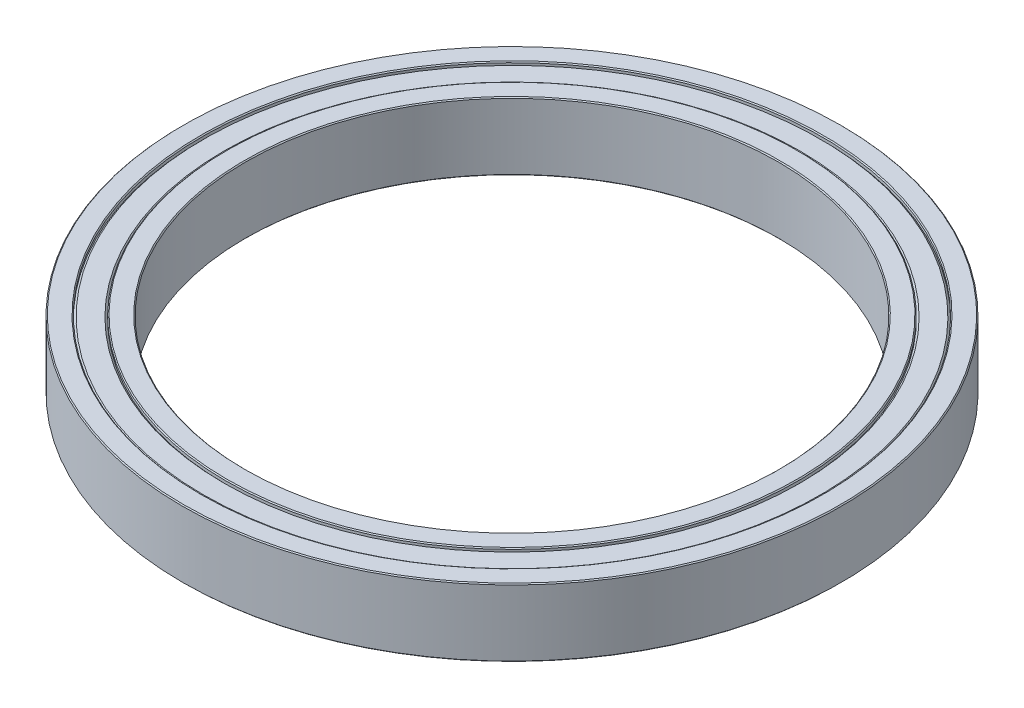
ISO-10303-21;
HEADER;
FILE_DESCRIPTION(('STEP AP214'),'2;1');
FILE_NAME('part.step','',(''),(''),'','','');
FILE_SCHEMA(('AUTOMOTIVE_DESIGN { 1 0 10303 214 1 1 1 1 }'));
ENDSEC;
DATA;
#1=APPLICATION_CONTEXT('core data for automotive mechanical design processes');
#2=APPLICATION_PROTOCOL_DEFINITION('international standard','automotive_design',2000,#1);
#3=PRODUCT_CONTEXT('',#1,'mechanical');
#4=PRODUCT('Part','Part','',(#3));
#5=PRODUCT_RELATED_PRODUCT_CATEGORY('part','',(#4));
#6=PRODUCT_DEFINITION_FORMATION('','',#4);
#7=PRODUCT_DEFINITION_CONTEXT('part definition',#1,'design');
#8=PRODUCT_DEFINITION('design','',#6,#7);
#9=PRODUCT_DEFINITION_SHAPE('','',#8);
#10=(LENGTH_UNIT() NAMED_UNIT(*) SI_UNIT(.MILLI.,.METRE.));
#11=(NAMED_UNIT(*) PLANE_ANGLE_UNIT() SI_UNIT($,.RADIAN.));
#12=(NAMED_UNIT(*) SI_UNIT($,.STERADIAN.) SOLID_ANGLE_UNIT());
#13=UNCERTAINTY_MEASURE_WITH_UNIT(LENGTH_MEASURE(1.E-05),#10,'distance_accuracy_value','');
#14=(GEOMETRIC_REPRESENTATION_CONTEXT(3) GLOBAL_UNCERTAINTY_ASSIGNED_CONTEXT((#13)) GLOBAL_UNIT_ASSIGNED_CONTEXT((#10,
#11,#12)) REPRESENTATION_CONTEXT('',''));
#15=CARTESIAN_POINT('',(0.,0.,0.));
#16=DIRECTION('',(0.,0.,1.));
#17=DIRECTION('',(1.,0.,0.));
#18=AXIS2_PLACEMENT_3D('',#15,#16,#17);
#19=CARTESIAN_POINT('',(0.,-3.5,0.));
#20=DIRECTION('',(0.,1.,0.));
#21=DIRECTION('',(0.,0.,1.));
#22=AXIS2_PLACEMENT_3D('',#19,#20,#21);
#23=PLANE('',#22);
#24=CARTESIAN_POINT('',(0.,-3.5,0.));
#25=DIRECTION('',(0.,1.,0.));
#26=DIRECTION('',(0.,0.,1.));
#27=AXIS2_PLACEMENT_3D('',#24,#25,#26);
#28=CIRCLE('',#27,32.1);
#29=CARTESIAN_POINT('',(0.,-3.50000000000001,32.1));
#30=VERTEX_POINT('',#29);
#31=EDGE_CURVE('E61',#30,#30,#28,.T.);
#32=ORIENTED_EDGE('',*,*,#31,.T.);
#33=EDGE_LOOP('',(#32));
#34=FACE_BOUND('',#33,.T.);
#35=CARTESIAN_POINT('',(0.,-3.5,0.));
#36=DIRECTION('',(0.,1.,0.));
#37=DIRECTION('',(0.,0.,1.));
#38=AXIS2_PLACEMENT_3D('',#35,#36,#37);
#39=CIRCLE('',#38,33.9);
#40=CARTESIAN_POINT('',(0.,-3.50000000000001,33.9));
#41=VERTEX_POINT('',#40);
#42=EDGE_CURVE('E64',#41,#41,#39,.F.);
#43=ORIENTED_EDGE('',*,*,#42,.T.);
#44=EDGE_LOOP('',(#43));
#45=FACE_BOUND('',#44,.T.);
#46=ADVANCED_FACE('F35',(#34,#45),#23,.F.);
#47=CARTESIAN_POINT('',(0.,-3.5,0.));
#48=DIRECTION('',(0.,1.,0.));
#49=DIRECTION('',(0.,0.,1.));
#50=AXIS2_PLACEMENT_3D('',#47,#48,#49);
#51=CIRCLE('',#50,27.6);
#52=CARTESIAN_POINT('',(0.,-3.50000000000001,27.6));
#53=VERTEX_POINT('',#52);
#54=EDGE_CURVE('E85',#53,#53,#51,.T.);
#55=ORIENTED_EDGE('',*,*,#54,.T.);
#56=EDGE_LOOP('',(#55));
#57=FACE_BOUND('',#56,.T.);
#58=CARTESIAN_POINT('',(0.,-3.5,0.));
#59=DIRECTION('',(0.,1.,0.));
#60=DIRECTION('',(0.,0.,1.));
#61=AXIS2_PLACEMENT_3D('',#58,#59,#60);
#62=CIRCLE('',#61,29.4);
#63=CARTESIAN_POINT('',(0.,-3.50000000000001,29.4));
#64=VERTEX_POINT('',#63);
#65=EDGE_CURVE('E88',#64,#64,#62,.F.);
#66=ORIENTED_EDGE('',*,*,#65,.T.);
#67=EDGE_LOOP('',(#66));
#68=FACE_BOUND('',#67,.T.);
#69=ADVANCED_FACE('F142',(#57,#68),#23,.F.);
#70=CARTESIAN_POINT('',(0.,3.5,0.));
#71=DIRECTION('',(0.,1.,0.));
#72=DIRECTION('',(0.,0.,1.));
#73=AXIS2_PLACEMENT_3D('',#70,#71,#72);
#74=PLANE('',#73);
#75=CARTESIAN_POINT('',(0.,3.5,0.));
#76=DIRECTION('',(0.,1.,0.));
#77=DIRECTION('',(0.,0.,1.));
#78=AXIS2_PLACEMENT_3D('',#75,#76,#77);
#79=CIRCLE('',#78,32.1);
#80=CARTESIAN_POINT('',(0.,3.49999999999999,32.1));
#81=VERTEX_POINT('',#80);
#82=EDGE_CURVE('E46',#81,#81,#79,.F.);
#83=ORIENTED_EDGE('',*,*,#82,.T.);
#84=EDGE_LOOP('',(#83));
#85=FACE_BOUND('',#84,.T.);
#86=CARTESIAN_POINT('',(0.,3.5,0.));
#87=DIRECTION('',(0.,1.,0.));
#88=DIRECTION('',(0.,0.,1.));
#89=AXIS2_PLACEMENT_3D('',#86,#87,#88);
#90=CIRCLE('',#89,33.9);
#91=CARTESIAN_POINT('',(0.,3.49999999999999,33.9));
#92=VERTEX_POINT('',#91);
#93=EDGE_CURVE('E50',#92,#92,#90,.T.);
#94=ORIENTED_EDGE('',*,*,#93,.T.);
#95=EDGE_LOOP('',(#94));
#96=FACE_BOUND('',#95,.T.);
#97=ADVANCED_FACE('F148',(#85,#96),#74,.T.);
#98=CARTESIAN_POINT('',(0.,3.5,0.));
#99=DIRECTION('',(0.,1.,0.));
#100=DIRECTION('',(0.,0.,1.));
#101=AXIS2_PLACEMENT_3D('',#98,#99,#100);
#102=CIRCLE('',#101,27.6);
#103=CARTESIAN_POINT('',(0.,3.49999999999999,27.6));
#104=VERTEX_POINT('',#103);
#105=EDGE_CURVE('E73',#104,#104,#102,.F.);
#106=ORIENTED_EDGE('',*,*,#105,.T.);
#107=EDGE_LOOP('',(#106));
#108=FACE_BOUND('',#107,.T.);
#109=CARTESIAN_POINT('',(0.,3.5,0.));
#110=DIRECTION('',(0.,1.,0.));
#111=DIRECTION('',(0.,0.,1.));
#112=AXIS2_PLACEMENT_3D('',#109,#110,#111);
#113=CIRCLE('',#112,29.4);
#114=CARTESIAN_POINT('',(0.,3.49999999999999,29.4));
#115=VERTEX_POINT('',#114);
#116=EDGE_CURVE('E76',#115,#115,#113,.T.);
#117=ORIENTED_EDGE('',*,*,#116,.T.);
#118=EDGE_LOOP('',(#117));
#119=FACE_BOUND('',#118,.T.);
#120=ADVANCED_FACE('F158',(#108,#119),#74,.T.);
#121=CARTESIAN_POINT('',(0.,3.49999999999999,0.));
#122=DIRECTION('',(0.,1.,0.));
#123=DIRECTION('',(0.,0.,1.));
#124=AXIS2_PLACEMENT_3D('',#121,#122,#123);
#125=CYLINDRICAL_SURFACE('',#124,27.5);
#126=CARTESIAN_POINT('',(0.,-3.4,0.));
#127=DIRECTION('',(0.,1.,0.));
#128=DIRECTION('',(0.,0.,1.));
#129=AXIS2_PLACEMENT_3D('',#126,#127,#128);
#130=CIRCLE('',#129,27.5);
#131=CARTESIAN_POINT('',(0.,-3.4,27.5));
#132=VERTEX_POINT('',#131);
#133=EDGE_CURVE('E79',#132,#132,#130,.F.);
#134=ORIENTED_EDGE('',*,*,#133,.T.);
#135=EDGE_LOOP('',(#134));
#136=FACE_BOUND('',#135,.T.);
#137=CARTESIAN_POINT('',(0.,3.39999999999997,0.));
#138=DIRECTION('',(0.,1.,0.));
#139=DIRECTION('',(0.,0.,1.));
#140=AXIS2_PLACEMENT_3D('',#137,#138,#139);
#141=CIRCLE('',#140,27.5);
#142=CARTESIAN_POINT('',(0.,3.39999999999997,27.5));
#143=VERTEX_POINT('',#142);
#144=EDGE_CURVE('E82',#143,#143,#141,.T.);
#145=ORIENTED_EDGE('',*,*,#144,.T.);
#146=EDGE_LOOP('',(#145));
#147=FACE_BOUND('',#146,.T.);
#148=ADVANCED_FACE('F155',(#136,#147),#125,.F.);
#149=CARTESIAN_POINT('',(0.,3.49999999999999,0.));
#150=DIRECTION('',(0.,1.,0.));
#151=DIRECTION('',(0.,0.,1.));
#152=AXIS2_PLACEMENT_3D('',#149,#150,#151);
#153=CYLINDRICAL_SURFACE('',#152,34.);
#154=CARTESIAN_POINT('',(0.,-3.39999999999999,0.));
#155=DIRECTION('',(0.,1.,0.));
#156=DIRECTION('',(0.,0.,1.));
#157=AXIS2_PLACEMENT_3D('',#154,#155,#156);
#158=CIRCLE('',#157,34.);
#159=CARTESIAN_POINT('',(0.,-3.4,34.));
#160=VERTEX_POINT('',#159);
#161=EDGE_CURVE('E10',#160,#160,#158,.T.);
#162=ORIENTED_EDGE('',*,*,#161,.T.);
#163=EDGE_LOOP('',(#162));
#164=FACE_BOUND('',#163,.T.);
#165=CARTESIAN_POINT('',(0.,3.39999999999998,0.));
#166=DIRECTION('',(0.,1.,0.));
#167=DIRECTION('',(0.,0.,1.));
#168=AXIS2_PLACEMENT_3D('',#165,#166,#167);
#169=CIRCLE('',#168,34.);
#170=CARTESIAN_POINT('',(0.,3.39999999999997,34.));
#171=VERTEX_POINT('',#170);
#172=EDGE_CURVE('E42',#171,#171,#169,.F.);
#173=ORIENTED_EDGE('',*,*,#172,.T.);
#174=EDGE_LOOP('',(#173));
#175=FACE_BOUND('',#174,.T.);
#176=ADVANCED_FACE('F153',(#164,#175),#153,.T.);
#177=CARTESIAN_POINT('',(0.,3.29999999999999,0.));
#178=DIRECTION('',(0.,-1.,0.));
#179=DIRECTION('',(0.,0.,-1.));
#180=AXIS2_PLACEMENT_3D('',#177,#178,#179);
#181=CONICAL_SURFACE('',#180,31.8,0.785398163397435);
#182=CARTESIAN_POINT('',(0.,3.09999999999999,0.));
#183=DIRECTION('',(0.,1.,0.));
#184=DIRECTION('',(0.,0.,1.));
#185=AXIS2_PLACEMENT_3D('',#182,#183,#184);
#186=CIRCLE('',#185,32.);
#187=CARTESIAN_POINT('',(0.,3.09999999999998,32.));
#188=VERTEX_POINT('',#187);
#189=EDGE_CURVE('E91',#188,#188,#186,.T.);
#190=ORIENTED_EDGE('',*,*,#189,.T.);
#191=EDGE_LOOP('',(#190));
#192=FACE_BOUND('',#191,.T.);
#193=CARTESIAN_POINT('',(0.,3.29999999999999,0.));
#194=DIRECTION('',(0.,1.,0.));
#195=DIRECTION('',(0.,0.,1.));
#196=AXIS2_PLACEMENT_3D('',#193,#194,#195);
#197=CIRCLE('',#196,31.8);
#198=CARTESIAN_POINT('',(0.,3.29999999999998,31.8));
#199=VERTEX_POINT('',#198);
#200=EDGE_CURVE('E100',#199,#199,#197,.T.);
#201=ORIENTED_EDGE('',*,*,#200,.F.);
#202=EDGE_LOOP('',(#201));
#203=FACE_BOUND('',#202,.T.);
#204=ADVANCED_FACE('F276',(#192,#203),#181,.T.);
#205=CARTESIAN_POINT('',(0.,3.49999999999999,0.));
#206=DIRECTION('',(0.,1.,0.));
#207=DIRECTION('',(0.,0.,1.));
#208=AXIS2_PLACEMENT_3D('',#205,#206,#207);
#209=CYLINDRICAL_SURFACE('',#208,32.);
#210=CARTESIAN_POINT('',(0.,3.39999999999995,0.));
#211=DIRECTION('',(0.,1.,0.));
#212=DIRECTION('',(0.,0.,1.));
#213=AXIS2_PLACEMENT_3D('',#210,#211,#212);
#214=CIRCLE('',#213,32.);
#215=CARTESIAN_POINT('',(0.,3.39999999999995,32.));
#216=VERTEX_POINT('',#215);
#217=EDGE_CURVE('E55',#216,#216,#214,.T.);
#218=ORIENTED_EDGE('',*,*,#217,.T.);
#219=EDGE_LOOP('',(#218));
#220=FACE_BOUND('',#219,.T.);
#221=ORIENTED_EDGE('',*,*,#189,.F.);
#222=EDGE_LOOP('',(#221));
#223=FACE_BOUND('',#222,.T.);
#224=ADVANCED_FACE('F264',(#220,#223),#209,.F.);
#225=CARTESIAN_POINT('',(0.,3.49999999999999,0.));
#226=DIRECTION('',(0.,1.,0.));
#227=DIRECTION('',(0.,0.,1.));
#228=AXIS2_PLACEMENT_3D('',#225,#226,#227);
#229=CYLINDRICAL_SURFACE('',#228,29.5);
#230=CARTESIAN_POINT('',(0.,3.39999999999997,0.));
#231=DIRECTION('',(0.,1.,0.));
#232=DIRECTION('',(0.,0.,1.));
#233=AXIS2_PLACEMENT_3D('',#230,#231,#232);
#234=CIRCLE('',#233,29.5);
#235=CARTESIAN_POINT('',(0.,3.39999999999996,29.5));
#236=VERTEX_POINT('',#235);
#237=EDGE_CURVE('E67',#236,#236,#234,.F.);
#238=ORIENTED_EDGE('',*,*,#237,.T.);
#239=EDGE_LOOP('',(#238));
#240=FACE_BOUND('',#239,.T.);
#241=CARTESIAN_POINT('',(0.,3.09999999999999,0.));
#242=DIRECTION('',(0.,1.,0.));
#243=DIRECTION('',(0.,0.,1.));
#244=AXIS2_PLACEMENT_3D('',#241,#242,#243);
#245=CIRCLE('',#244,29.5);
#246=CARTESIAN_POINT('',(0.,3.09999999999998,29.5));
#247=VERTEX_POINT('',#246);
#248=EDGE_CURVE('E94',#247,#247,#245,.T.);
#249=ORIENTED_EDGE('',*,*,#248,.T.);
#250=EDGE_LOOP('',(#249));
#251=FACE_BOUND('',#250,.T.);
#252=ADVANCED_FACE('F258',(#240,#251),#229,.T.);
#253=CARTESIAN_POINT('',(0.,3.09999999999999,0.));
#254=DIRECTION('',(0.,1.,0.));
#255=DIRECTION('',(0.,0.,1.));
#256=AXIS2_PLACEMENT_3D('',#253,#254,#255);
#257=CONICAL_SURFACE('',#256,29.5,0.785398163397441);
#258=CARTESIAN_POINT('',(0.,3.29999999999999,0.));
#259=DIRECTION('',(0.,1.,0.));
#260=DIRECTION('',(0.,0.,1.));
#261=AXIS2_PLACEMENT_3D('',#258,#259,#260);
#262=CIRCLE('',#261,29.7);
#263=CARTESIAN_POINT('',(0.,3.29999999999999,29.7));
#264=VERTEX_POINT('',#263);
#265=EDGE_CURVE('E97',#264,#264,#262,.T.);
#266=ORIENTED_EDGE('',*,*,#265,.T.);
#267=EDGE_LOOP('',(#266));
#268=FACE_BOUND('',#267,.T.);
#269=ORIENTED_EDGE('',*,*,#248,.F.);
#270=EDGE_LOOP('',(#269));
#271=FACE_BOUND('',#270,.T.);
#272=ADVANCED_FACE('F263',(#268,#271),#257,.F.);
#273=CARTESIAN_POINT('',(0.,3.29999999999999,0.));
#274=DIRECTION('',(0.,1.,0.));
#275=DIRECTION('',(0.,0.,1.));
#276=AXIS2_PLACEMENT_3D('',#273,#274,#275);
#277=PLANE('',#276);
#278=ORIENTED_EDGE('',*,*,#200,.T.);
#279=EDGE_LOOP('',(#278));
#280=FACE_BOUND('',#279,.T.);
#281=ORIENTED_EDGE('',*,*,#265,.F.);
#282=EDGE_LOOP('',(#281));
#283=FACE_BOUND('',#282,.T.);
#284=ADVANCED_FACE('F339',(#280,#283),#277,.T.);
#285=CARTESIAN_POINT('',(0.,-3.29999999999999,0.));
#286=DIRECTION('',(0.,1.,0.));
#287=DIRECTION('',(0.,0.,-1.));
#288=AXIS2_PLACEMENT_3D('',#285,#286,#287);
#289=CONICAL_SURFACE('',#288,31.8,0.785398163397435);
#290=CARTESIAN_POINT('',(0.,-3.09999999999999,0.));
#291=DIRECTION('',(0.,1.,0.));
#292=DIRECTION('',(0.,0.,1.));
#293=AXIS2_PLACEMENT_3D('',#290,#291,#292);
#294=CIRCLE('',#293,32.);
#295=CARTESIAN_POINT('',(0.,-3.09999999999998,32.));
#296=VERTEX_POINT('',#295);
#297=EDGE_CURVE('E103',#296,#296,#294,.T.);
#298=ORIENTED_EDGE('',*,*,#297,.F.);
#299=EDGE_LOOP('',(#298));
#300=FACE_BOUND('',#299,.T.);
#301=CARTESIAN_POINT('',(0.,-3.29999999999999,0.));
#302=DIRECTION('',(0.,1.,0.));
#303=DIRECTION('',(0.,0.,1.));
#304=AXIS2_PLACEMENT_3D('',#301,#302,#303);
#305=CIRCLE('',#304,31.8);
#306=CARTESIAN_POINT('',(0.,-3.29999999999998,31.8));
#307=VERTEX_POINT('',#306);
#308=EDGE_CURVE('E112',#307,#307,#305,.T.);
#309=ORIENTED_EDGE('',*,*,#308,.T.);
#310=EDGE_LOOP('',(#309));
#311=FACE_BOUND('',#310,.T.);
#312=ADVANCED_FACE('F116',(#300,#311),#289,.T.);
#313=CARTESIAN_POINT('',(0.,-3.49999999999999,0.));
#314=DIRECTION('',(0.,-1.,0.));
#315=DIRECTION('',(0.,0.,1.));
#316=AXIS2_PLACEMENT_3D('',#313,#314,#315);
#317=CYLINDRICAL_SURFACE('',#316,32.);
#318=CARTESIAN_POINT('',(0.,-3.40000000000001,0.));
#319=DIRECTION('',(0.,1.,0.));
#320=DIRECTION('',(0.,0.,1.));
#321=AXIS2_PLACEMENT_3D('',#318,#319,#320);
#322=CIRCLE('',#321,32.);
#323=CARTESIAN_POINT('',(0.,-3.4,32.));
#324=VERTEX_POINT('',#323);
#325=EDGE_CURVE('E58',#324,#324,#322,.F.);
#326=ORIENTED_EDGE('',*,*,#325,.T.);
#327=EDGE_LOOP('',(#326));
#328=FACE_BOUND('',#327,.T.);
#329=ORIENTED_EDGE('',*,*,#297,.T.);
#330=EDGE_LOOP('',(#329));
#331=FACE_BOUND('',#330,.T.);
#332=ADVANCED_FACE('F133',(#328,#331),#317,.F.);
#333=CARTESIAN_POINT('',(0.,-3.49999999999999,0.));
#334=DIRECTION('',(0.,-1.,0.));
#335=DIRECTION('',(0.,0.,1.));
#336=AXIS2_PLACEMENT_3D('',#333,#334,#335);
#337=CYLINDRICAL_SURFACE('',#336,29.5);
#338=CARTESIAN_POINT('',(0.,-3.39999999999998,0.));
#339=DIRECTION('',(0.,1.,0.));
#340=DIRECTION('',(0.,0.,1.));
#341=AXIS2_PLACEMENT_3D('',#338,#339,#340);
#342=CIRCLE('',#341,29.5);
#343=CARTESIAN_POINT('',(0.,-3.39999999999997,29.5));
#344=VERTEX_POINT('',#343);
#345=EDGE_CURVE('E70',#344,#344,#342,.T.);
#346=ORIENTED_EDGE('',*,*,#345,.T.);
#347=EDGE_LOOP('',(#346));
#348=FACE_BOUND('',#347,.T.);
#349=CARTESIAN_POINT('',(0.,-3.09999999999999,0.));
#350=DIRECTION('',(0.,1.,0.));
#351=DIRECTION('',(0.,0.,1.));
#352=AXIS2_PLACEMENT_3D('',#349,#350,#351);
#353=CIRCLE('',#352,29.5);
#354=CARTESIAN_POINT('',(0.,-3.09999999999998,29.5));
#355=VERTEX_POINT('',#354);
#356=EDGE_CURVE('E106',#355,#355,#353,.T.);
#357=ORIENTED_EDGE('',*,*,#356,.F.);
#358=EDGE_LOOP('',(#357));
#359=FACE_BOUND('',#358,.T.);
#360=ADVANCED_FACE('F128',(#348,#359),#337,.T.);
#361=CARTESIAN_POINT('',(0.,-3.09999999999999,0.));
#362=DIRECTION('',(0.,-1.,0.));
#363=DIRECTION('',(0.,0.,1.));
#364=AXIS2_PLACEMENT_3D('',#361,#362,#363);
#365=CONICAL_SURFACE('',#364,29.5,0.785398163397441);
#366=CARTESIAN_POINT('',(0.,-3.29999999999999,0.));
#367=DIRECTION('',(0.,1.,0.));
#368=DIRECTION('',(0.,0.,1.));
#369=AXIS2_PLACEMENT_3D('',#366,#367,#368);
#370=CIRCLE('',#369,29.7);
#371=CARTESIAN_POINT('',(0.,-3.29999999999999,29.7));
#372=VERTEX_POINT('',#371);
#373=EDGE_CURVE('E109',#372,#372,#370,.T.);
#374=ORIENTED_EDGE('',*,*,#373,.F.);
#375=EDGE_LOOP('',(#374));
#376=FACE_BOUND('',#375,.T.);
#377=ORIENTED_EDGE('',*,*,#356,.T.);
#378=EDGE_LOOP('',(#377));
#379=FACE_BOUND('',#378,.T.);
#380=ADVANCED_FACE('F122',(#376,#379),#365,.F.);
#381=CARTESIAN_POINT('',(0.,-3.29999999999999,0.));
#382=DIRECTION('',(0.,-1.,0.));
#383=DIRECTION('',(0.,0.,1.));
#384=AXIS2_PLACEMENT_3D('',#381,#382,#383);
#385=PLANE('',#384);
#386=ORIENTED_EDGE('',*,*,#308,.F.);
#387=EDGE_LOOP('',(#386));
#388=FACE_BOUND('',#387,.T.);
#389=ORIENTED_EDGE('',*,*,#373,.T.);
#390=EDGE_LOOP('',(#389));
#391=FACE_BOUND('',#390,.T.);
#392=ADVANCED_FACE('F118',(#388,#391),#385,.T.);
#393=CARTESIAN_POINT('',(0.,-3.5,0.));
#394=DIRECTION('',(0.,-1.,0.));
#395=DIRECTION('',(0.,0.,-1.));
#396=AXIS2_PLACEMENT_3D('',#393,#394,#395);
#397=CONICAL_SURFACE('',#396,27.6,0.785398163397448);
#398=ORIENTED_EDGE('',*,*,#133,.F.);
#399=EDGE_LOOP('',(#398));
#400=FACE_BOUND('',#399,.T.);
#401=ORIENTED_EDGE('',*,*,#54,.F.);
#402=EDGE_LOOP('',(#401));
#403=FACE_BOUND('',#402,.T.);
#404=ADVANCED_FACE('F121',(#400,#403),#397,.F.);
#405=CARTESIAN_POINT('',(0.,3.39999999999997,0.));
#406=DIRECTION('',(0.,1.,0.));
#407=DIRECTION('',(0.,0.,1.));
#408=AXIS2_PLACEMENT_3D('',#405,#406,#407);
#409=CONICAL_SURFACE('',#408,27.5,0.785398163397483);
#410=ORIENTED_EDGE('',*,*,#105,.F.);
#411=EDGE_LOOP('',(#410));
#412=FACE_BOUND('',#411,.T.);
#413=ORIENTED_EDGE('',*,*,#144,.F.);
#414=EDGE_LOOP('',(#413));
#415=FACE_BOUND('',#414,.T.);
#416=ADVANCED_FACE('F165',(#412,#415),#409,.F.);
#417=CARTESIAN_POINT('',(0.,-3.39999999999998,0.));
#418=DIRECTION('',(0.,1.,0.));
#419=DIRECTION('',(0.,0.,1.));
#420=AXIS2_PLACEMENT_3D('',#417,#418,#419);
#421=CONICAL_SURFACE('',#420,29.5,0.785398163397468);
#422=ORIENTED_EDGE('',*,*,#65,.F.);
#423=EDGE_LOOP('',(#422));
#424=FACE_BOUND('',#423,.T.);
#425=ORIENTED_EDGE('',*,*,#345,.F.);
#426=EDGE_LOOP('',(#425));
#427=FACE_BOUND('',#426,.T.);
#428=ADVANCED_FACE('F169',(#424,#427),#421,.T.);
#429=CARTESIAN_POINT('',(0.,3.5,0.));
#430=DIRECTION('',(0.,-1.,0.));
#431=DIRECTION('',(0.,0.,-1.));
#432=AXIS2_PLACEMENT_3D('',#429,#430,#431);
#433=CONICAL_SURFACE('',#432,29.4,0.785398163397463);
#434=ORIENTED_EDGE('',*,*,#237,.F.);
#435=EDGE_LOOP('',(#434));
#436=FACE_BOUND('',#435,.T.);
#437=ORIENTED_EDGE('',*,*,#116,.F.);
#438=EDGE_LOOP('',(#437));
#439=FACE_BOUND('',#438,.T.);
#440=ADVANCED_FACE('F173',(#436,#439),#433,.T.);
#441=CARTESIAN_POINT('',(0.,-3.5,0.));
#442=DIRECTION('',(0.,-1.,0.));
#443=DIRECTION('',(0.,0.,-1.));
#444=AXIS2_PLACEMENT_3D('',#441,#442,#443);
#445=CONICAL_SURFACE('',#444,32.1,0.785398163397448);
#446=ORIENTED_EDGE('',*,*,#325,.F.);
#447=EDGE_LOOP('',(#446));
#448=FACE_BOUND('',#447,.T.);
#449=ORIENTED_EDGE('',*,*,#31,.F.);
#450=EDGE_LOOP('',(#449));
#451=FACE_BOUND('',#450,.T.);
#452=ADVANCED_FACE('F177',(#448,#451),#445,.F.);
#453=CARTESIAN_POINT('',(0.,3.39999999999995,0.));
#454=DIRECTION('',(0.,1.,0.));
#455=DIRECTION('',(0.,0.,1.));
#456=AXIS2_PLACEMENT_3D('',#453,#454,#455);
#457=CONICAL_SURFACE('',#456,32.,0.785398163397414);
#458=ORIENTED_EDGE('',*,*,#82,.F.);
#459=EDGE_LOOP('',(#458));
#460=FACE_BOUND('',#459,.T.);
#461=ORIENTED_EDGE('',*,*,#217,.F.);
#462=EDGE_LOOP('',(#461));
#463=FACE_BOUND('',#462,.T.);
#464=ADVANCED_FACE('F181',(#460,#463),#457,.F.);
#465=CARTESIAN_POINT('',(0.,-3.39999999999999,0.));
#466=DIRECTION('',(0.,1.,0.));
#467=DIRECTION('',(0.,0.,1.));
#468=AXIS2_PLACEMENT_3D('',#465,#466,#467);
#469=CONICAL_SURFACE('',#468,34.,0.785398163397448);
#470=ORIENTED_EDGE('',*,*,#42,.F.);
#471=EDGE_LOOP('',(#470));
#472=FACE_BOUND('',#471,.T.);
#473=ORIENTED_EDGE('',*,*,#161,.F.);
#474=EDGE_LOOP('',(#473));
#475=FACE_BOUND('',#474,.T.);
#476=ADVANCED_FACE('F184',(#472,#475),#469,.T.);
#477=CARTESIAN_POINT('',(0.,3.5,0.));
#478=DIRECTION('',(0.,-1.,0.));
#479=DIRECTION('',(0.,0.,-1.));
#480=AXIS2_PLACEMENT_3D('',#477,#478,#479);
#481=CONICAL_SURFACE('',#480,33.9,0.785398163397483);
#482=ORIENTED_EDGE('',*,*,#172,.F.);
#483=EDGE_LOOP('',(#482));
#484=FACE_BOUND('',#483,.T.);
#485=ORIENTED_EDGE('',*,*,#93,.F.);
#486=EDGE_LOOP('',(#485));
#487=FACE_BOUND('',#486,.T.);
#488=ADVANCED_FACE('F37',(#484,#487),#481,.T.);
#489=CLOSED_SHELL('',(#46,#69,#97,#120,#148,#176,#204,#224,#252,#272,#284,#312,#332,#360,#380,
#392,#404,#416,#428,#440,#452,#464,#476,#488));
#490=MANIFOLD_SOLID_BREP('B2',#489);
#491=ADVANCED_BREP_SHAPE_REPRESENTATION('',(#18,#490),#14);
#492=SHAPE_DEFINITION_REPRESENTATION(#9,#491);
ENDSEC;
END-ISO-10303-21;
